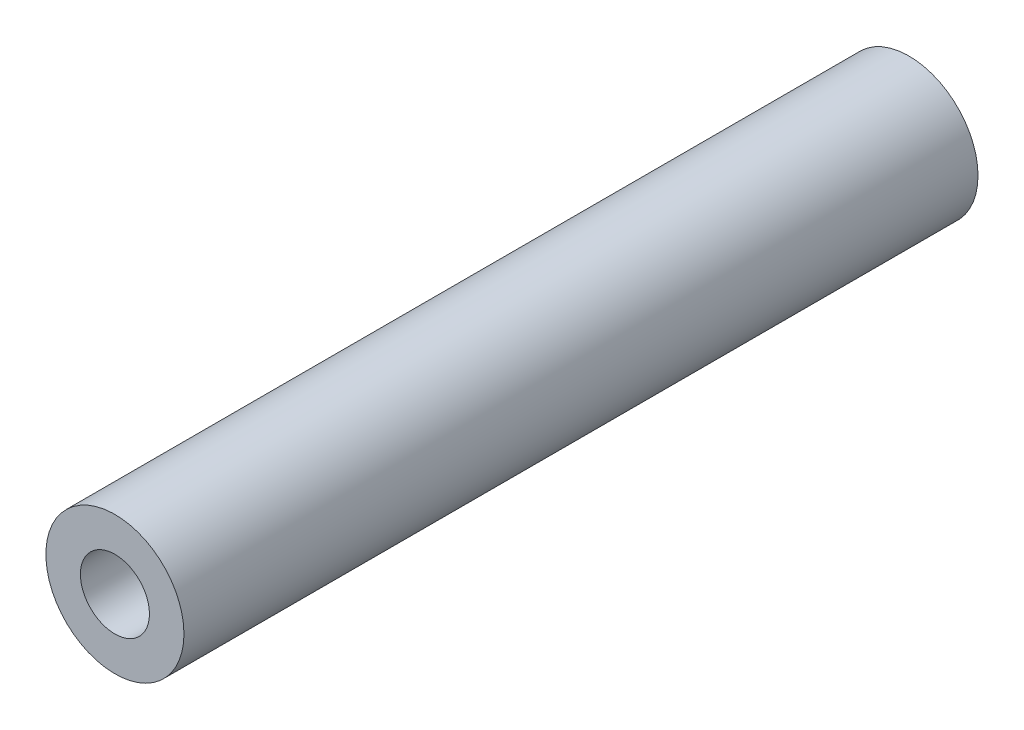
ISO-10303-21;
HEADER;
FILE_DESCRIPTION(('STEP AP214'),'2;1');
FILE_NAME('part.step','',(''),(''),'','','');
FILE_SCHEMA(('AUTOMOTIVE_DESIGN { 1 0 10303 214 1 1 1 1 }'));
ENDSEC;
DATA;
#1=APPLICATION_CONTEXT('core data for automotive mechanical design processes');
#2=APPLICATION_PROTOCOL_DEFINITION('international standard','automotive_design',2000,#1);
#3=PRODUCT_CONTEXT('',#1,'mechanical');
#4=PRODUCT('Part','Part','',(#3));
#5=PRODUCT_RELATED_PRODUCT_CATEGORY('part','',(#4));
#6=PRODUCT_DEFINITION_FORMATION('','',#4);
#7=PRODUCT_DEFINITION_CONTEXT('part definition',#1,'design');
#8=PRODUCT_DEFINITION('design','',#6,#7);
#9=PRODUCT_DEFINITION_SHAPE('','',#8);
#10=(LENGTH_UNIT() NAMED_UNIT(*) SI_UNIT(.MILLI.,.METRE.));
#11=(NAMED_UNIT(*) PLANE_ANGLE_UNIT() SI_UNIT($,.RADIAN.));
#12=(NAMED_UNIT(*) SI_UNIT($,.STERADIAN.) SOLID_ANGLE_UNIT());
#13=UNCERTAINTY_MEASURE_WITH_UNIT(LENGTH_MEASURE(1.E-05),#10,'distance_accuracy_value','');
#14=(GEOMETRIC_REPRESENTATION_CONTEXT(3) GLOBAL_UNCERTAINTY_ASSIGNED_CONTEXT((#13)) GLOBAL_UNIT_ASSIGNED_CONTEXT((#10,
#11,#12)) REPRESENTATION_CONTEXT('',''));
#15=CARTESIAN_POINT('',(0.,0.,0.));
#16=DIRECTION('',(0.,0.,1.));
#17=DIRECTION('',(1.,0.,0.));
#18=AXIS2_PLACEMENT_3D('',#15,#16,#17);
#19=CARTESIAN_POINT('',(0.,0.,46.));
#20=DIRECTION('',(0.,0.,-1.));
#21=DIRECTION('',(-1.,0.,0.));
#22=AXIS2_PLACEMENT_3D('',#19,#20,#21);
#23=CYLINDRICAL_SURFACE('',#22,4.);
#24=CARTESIAN_POINT('',(0.,0.,46.));
#25=DIRECTION('',(0.,0.,1.));
#26=DIRECTION('',(1.,0.,0.));
#27=AXIS2_PLACEMENT_3D('',#24,#25,#26);
#28=CIRCLE('',#27,4.);
#29=CARTESIAN_POINT('',(4.,0.,46.));
#30=VERTEX_POINT('',#29);
#31=EDGE_CURVE('E10',#30,#30,#28,.T.);
#32=ORIENTED_EDGE('',*,*,#31,.F.);
#33=EDGE_LOOP('',(#32));
#34=FACE_BOUND('',#33,.T.);
#35=CARTESIAN_POINT('',(0.,0.,0.));
#36=DIRECTION('',(0.,0.,1.));
#37=DIRECTION('',(1.,0.,0.));
#38=AXIS2_PLACEMENT_3D('',#35,#36,#37);
#39=CIRCLE('',#38,4.);
#40=CARTESIAN_POINT('',(4.,0.,0.));
#41=VERTEX_POINT('',#40);
#42=EDGE_CURVE('E32',#41,#41,#39,.T.);
#43=ORIENTED_EDGE('',*,*,#42,.T.);
#44=EDGE_LOOP('',(#43));
#45=FACE_BOUND('',#44,.T.);
#46=ADVANCED_FACE('F29',(#34,#45),#23,.T.);
#47=CARTESIAN_POINT('',(0.,0.,46.));
#48=DIRECTION('',(0.,0.,1.));
#49=DIRECTION('',(1.,0.,0.));
#50=AXIS2_PLACEMENT_3D('',#47,#48,#49);
#51=PLANE('',#50);
#52=CARTESIAN_POINT('',(0.,0.,46.));
#53=DIRECTION('',(0.,0.,1.));
#54=DIRECTION('',(1.,0.,0.));
#55=AXIS2_PLACEMENT_3D('',#52,#53,#54);
#56=CIRCLE('',#55,2.);
#57=CARTESIAN_POINT('',(2.,0.,46.));
#58=VERTEX_POINT('',#57);
#59=EDGE_CURVE('E41',#58,#58,#56,.T.);
#60=ORIENTED_EDGE('',*,*,#59,.F.);
#61=EDGE_LOOP('',(#60));
#62=FACE_BOUND('',#61,.T.);
#63=ORIENTED_EDGE('',*,*,#31,.T.);
#64=EDGE_LOOP('',(#63));
#65=FACE_BOUND('',#64,.T.);
#66=ADVANCED_FACE('F66',(#62,#65),#51,.T.);
#67=CARTESIAN_POINT('',(0.,0.,0.));
#68=DIRECTION('',(0.,0.,1.));
#69=DIRECTION('',(1.,0.,0.));
#70=AXIS2_PLACEMENT_3D('',#67,#68,#69);
#71=PLANE('',#70);
#72=CARTESIAN_POINT('',(0.,0.,0.));
#73=DIRECTION('',(0.,0.,-1.));
#74=DIRECTION('',(-1.,0.,0.));
#75=AXIS2_PLACEMENT_3D('',#72,#73,#74);
#76=CIRCLE('',#75,2.);
#77=CARTESIAN_POINT('',(-2.,0.,0.));
#78=VERTEX_POINT('',#77);
#79=EDGE_CURVE('E47',#78,#78,#76,.T.);
#80=ORIENTED_EDGE('',*,*,#79,.F.);
#81=EDGE_LOOP('',(#80));
#82=FACE_BOUND('',#81,.T.);
#83=ORIENTED_EDGE('',*,*,#42,.F.);
#84=EDGE_LOOP('',(#83));
#85=FACE_BOUND('',#84,.T.);
#86=ADVANCED_FACE('F62',(#82,#85),#71,.F.);
#87=CARTESIAN_POINT('',(0.,0.,36.));
#88=DIRECTION('',(0.,0.,1.));
#89=DIRECTION('',(1.,0.,0.));
#90=AXIS2_PLACEMENT_3D('',#87,#88,#89);
#91=CYLINDRICAL_SURFACE('',#90,2.);
#92=CARTESIAN_POINT('',(0.,0.,36.));
#93=DIRECTION('',(0.,0.,1.));
#94=DIRECTION('',(1.,0.,0.));
#95=AXIS2_PLACEMENT_3D('',#92,#93,#94);
#96=CIRCLE('',#95,2.);
#97=CARTESIAN_POINT('',(2.,0.,36.));
#98=VERTEX_POINT('',#97);
#99=EDGE_CURVE('E39',#98,#98,#96,.T.);
#100=ORIENTED_EDGE('',*,*,#99,.F.);
#101=EDGE_LOOP('',(#100));
#102=FACE_BOUND('',#101,.T.);
#103=ORIENTED_EDGE('',*,*,#59,.T.);
#104=EDGE_LOOP('',(#103));
#105=FACE_BOUND('',#104,.T.);
#106=ADVANCED_FACE('F65',(#102,#105),#91,.F.);
#107=CARTESIAN_POINT('',(0.,0.,36.));
#108=DIRECTION('',(0.,0.,1.));
#109=DIRECTION('',(1.,0.,0.));
#110=AXIS2_PLACEMENT_3D('',#107,#108,#109);
#111=PLANE('',#110);
#112=ORIENTED_EDGE('',*,*,#99,.T.);
#113=EDGE_LOOP('',(#112));
#114=FACE_BOUND('',#113,.T.);
#115=ADVANCED_FACE('F58',(#114),#111,.T.);
#116=CARTESIAN_POINT('',(0.,0.,10.));
#117=DIRECTION('',(0.,0.,-1.));
#118=DIRECTION('',(-1.,0.,0.));
#119=AXIS2_PLACEMENT_3D('',#116,#117,#118);
#120=CYLINDRICAL_SURFACE('',#119,2.);
#121=CARTESIAN_POINT('',(0.,0.,10.));
#122=DIRECTION('',(0.,0.,-1.));
#123=DIRECTION('',(-1.,0.,0.));
#124=AXIS2_PLACEMENT_3D('',#121,#122,#123);
#125=CIRCLE('',#124,2.);
#126=CARTESIAN_POINT('',(-2.,0.,10.));
#127=VERTEX_POINT('',#126);
#128=EDGE_CURVE('E44',#127,#127,#125,.T.);
#129=ORIENTED_EDGE('',*,*,#128,.F.);
#130=EDGE_LOOP('',(#129));
#131=FACE_BOUND('',#130,.T.);
#132=ORIENTED_EDGE('',*,*,#79,.T.);
#133=EDGE_LOOP('',(#132));
#134=FACE_BOUND('',#133,.T.);
#135=ADVANCED_FACE('F55',(#131,#134),#120,.F.);
#136=CARTESIAN_POINT('',(0.,0.,10.));
#137=DIRECTION('',(0.,0.,-1.));
#138=DIRECTION('',(-1.,0.,0.));
#139=AXIS2_PLACEMENT_3D('',#136,#137,#138);
#140=PLANE('',#139);
#141=ORIENTED_EDGE('',*,*,#128,.T.);
#142=EDGE_LOOP('',(#141));
#143=FACE_BOUND('',#142,.T.);
#144=ADVANCED_FACE('F53',(#143),#140,.T.);
#145=CLOSED_SHELL('',(#46,#66,#86,#106,#115,#135,#144));
#146=MANIFOLD_SOLID_BREP('B2',#145);
#147=ADVANCED_BREP_SHAPE_REPRESENTATION('',(#18,#146),#14);
#148=SHAPE_DEFINITION_REPRESENTATION(#9,#147);
ENDSEC;
END-ISO-10303-21;
